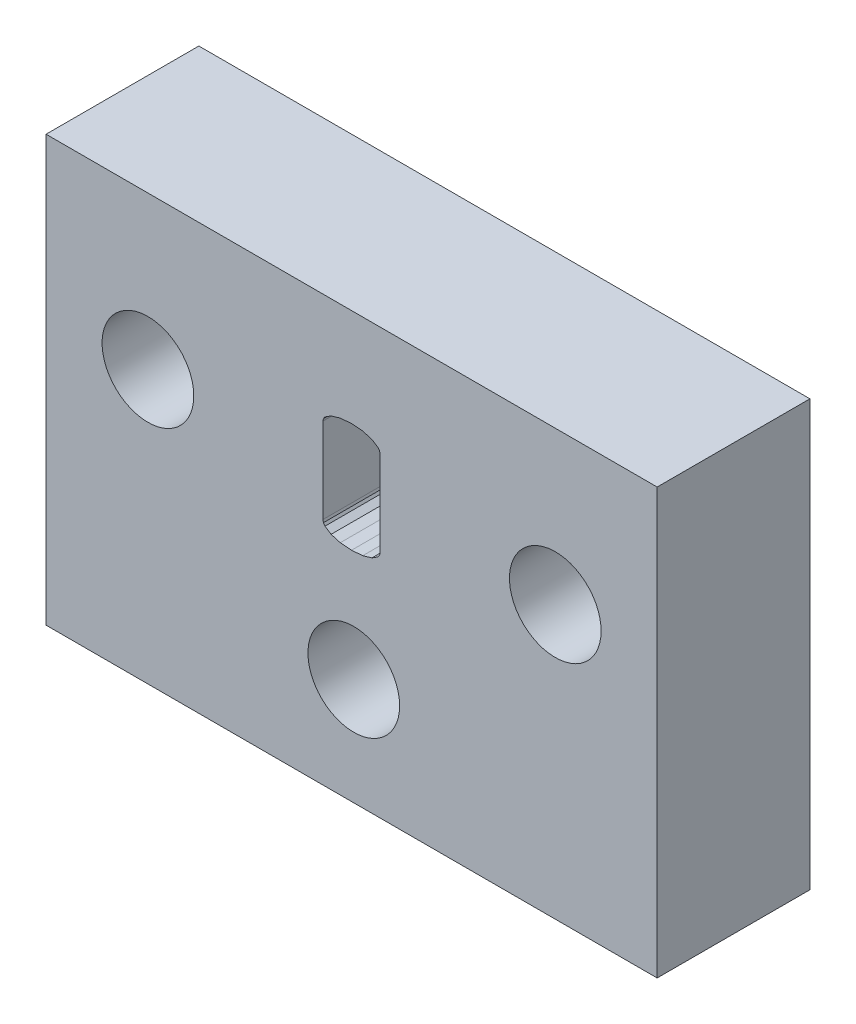
ISO-10303-21;
HEADER;
FILE_DESCRIPTION(('STEP AP214'),'2;1');
FILE_NAME('part.step','',(''),(''),'','','');
FILE_SCHEMA(('AUTOMOTIVE_DESIGN { 1 0 10303 214 1 1 1 1 }'));
ENDSEC;
DATA;
#1=APPLICATION_CONTEXT('core data for automotive mechanical design processes');
#2=APPLICATION_PROTOCOL_DEFINITION('international standard','automotive_design',2000,#1);
#3=PRODUCT_CONTEXT('',#1,'mechanical');
#4=PRODUCT('Part','Part','',(#3));
#5=PRODUCT_RELATED_PRODUCT_CATEGORY('part','',(#4));
#6=PRODUCT_DEFINITION_FORMATION('','',#4);
#7=PRODUCT_DEFINITION_CONTEXT('part definition',#1,'design');
#8=PRODUCT_DEFINITION('design','',#6,#7);
#9=PRODUCT_DEFINITION_SHAPE('','',#8);
#10=(LENGTH_UNIT() NAMED_UNIT(*) SI_UNIT(.MILLI.,.METRE.));
#11=(NAMED_UNIT(*) PLANE_ANGLE_UNIT() SI_UNIT($,.RADIAN.));
#12=(NAMED_UNIT(*) SI_UNIT($,.STERADIAN.) SOLID_ANGLE_UNIT());
#13=UNCERTAINTY_MEASURE_WITH_UNIT(LENGTH_MEASURE(1.E-05),#10,'distance_accuracy_value','');
#14=(GEOMETRIC_REPRESENTATION_CONTEXT(3) GLOBAL_UNCERTAINTY_ASSIGNED_CONTEXT((#13)) GLOBAL_UNIT_ASSIGNED_CONTEXT((#10,
#11,#12)) REPRESENTATION_CONTEXT('',''));
#15=CARTESIAN_POINT('',(0.,0.,0.));
#16=DIRECTION('',(0.,0.,1.));
#17=DIRECTION('',(1.,0.,0.));
#18=AXIS2_PLACEMENT_3D('',#15,#16,#17);
#19=CARTESIAN_POINT('',(0.,7.35355687780262,6.));
#20=DIRECTION('',(0.,-1.,0.));
#21=DIRECTION('',(0.,0.,-1.));
#22=AXIS2_PLACEMENT_3D('',#19,#20,#21);
#23=PLANE('',#22);
#24=DIRECTION('',(-1.,0.,0.));
#25=VECTOR('',#24,1.);
#26=CARTESIAN_POINT('',(0.,7.35355687780262,0.));
#27=LINE('',#26,#25);
#28=CARTESIAN_POINT('',(55.7766656600231,7.35355687780262,0.));
#29=VERTEX_POINT('',#28);
#30=CARTESIAN_POINT('',(31.7766733400216,7.35355687780262,0.));
#31=VERTEX_POINT('',#30);
#32=EDGE_CURVE('E317',#29,#31,#27,.T.);
#33=ORIENTED_EDGE('',*,*,#32,.F.);
#34=DIRECTION('',(0.,0.,-1.));
#35=VECTOR('',#34,1.);
#36=CARTESIAN_POINT('',(55.7766656600231,7.35355687780262,6.));
#37=LINE('',#36,#35);
#38=CARTESIAN_POINT('',(55.7766656600231,7.35355687780262,6.));
#39=VERTEX_POINT('',#38);
#40=EDGE_CURVE('E11',#39,#29,#37,.T.);
#41=ORIENTED_EDGE('',*,*,#40,.F.);
#42=DIRECTION('',(-1.,0.,0.));
#43=VECTOR('',#42,1.);
#44=CARTESIAN_POINT('',(0.,7.35355687780262,6.));
#45=LINE('',#44,#43);
#46=CARTESIAN_POINT('',(31.7766733400216,7.35355687780262,6.));
#47=VERTEX_POINT('',#46);
#48=EDGE_CURVE('E233',#39,#47,#45,.T.);
#49=ORIENTED_EDGE('',*,*,#48,.T.);
#50=DIRECTION('',(0.,0.,-1.));
#51=VECTOR('',#50,1.);
#52=CARTESIAN_POINT('',(31.7766733400216,7.35355687780262,6.));
#53=LINE('',#52,#51);
#54=EDGE_CURVE('E57',#47,#31,#53,.T.);
#55=ORIENTED_EDGE('',*,*,#54,.T.);
#56=EDGE_LOOP('',(#33,#41,#49,#55));
#57=FACE_BOUND('',#56,.T.);
#58=ADVANCED_FACE('F38',(#57),#23,.T.);
#59=CARTESIAN_POINT('',(55.7766656600231,0.,6.));
#60=DIRECTION('',(1.,0.,0.));
#61=DIRECTION('',(0.,0.,-1.));
#62=AXIS2_PLACEMENT_3D('',#59,#60,#61);
#63=PLANE('',#62);
#64=DIRECTION('',(0.,-1.,0.));
#65=VECTOR('',#64,1.);
#66=CARTESIAN_POINT('',(55.7766656600231,0.,0.));
#67=LINE('',#66,#65);
#68=CARTESIAN_POINT('',(55.7766656600231,24.0535515338035,0.));
#69=VERTEX_POINT('',#68);
#70=EDGE_CURVE('E222',#69,#29,#67,.T.);
#71=ORIENTED_EDGE('',*,*,#70,.F.);
#72=DIRECTION('',(0.,0.,-1.));
#73=VECTOR('',#72,1.);
#74=CARTESIAN_POINT('',(55.7766656600231,24.0535515338035,6.));
#75=LINE('',#74,#73);
#76=CARTESIAN_POINT('',(55.7766656600231,24.0535515338035,6.));
#77=VERTEX_POINT('',#76);
#78=EDGE_CURVE('E48',#77,#69,#75,.T.);
#79=ORIENTED_EDGE('',*,*,#78,.F.);
#80=DIRECTION('',(0.,-1.,0.));
#81=VECTOR('',#80,1.);
#82=CARTESIAN_POINT('',(55.7766656600231,0.,6.));
#83=LINE('',#82,#81);
#84=EDGE_CURVE('E220',#77,#39,#83,.T.);
#85=ORIENTED_EDGE('',*,*,#84,.T.);
#86=ORIENTED_EDGE('',*,*,#40,.T.);
#87=EDGE_LOOP('',(#71,#79,#85,#86));
#88=FACE_BOUND('',#87,.T.);
#89=ADVANCED_FACE('F219',(#88),#63,.T.);
#90=CARTESIAN_POINT('',(0.,24.0535515338035,6.));
#91=DIRECTION('',(0.,1.,0.));
#92=DIRECTION('',(0.,0.,1.));
#93=AXIS2_PLACEMENT_3D('',#90,#91,#92);
#94=PLANE('',#93);
#95=DIRECTION('',(1.,0.,0.));
#96=VECTOR('',#95,1.);
#97=CARTESIAN_POINT('',(0.,24.0535515338035,0.));
#98=LINE('',#97,#96);
#99=CARTESIAN_POINT('',(31.7766733400216,24.0535515338035,0.));
#100=VERTEX_POINT('',#99);
#101=EDGE_CURVE('E320',#100,#69,#98,.T.);
#102=ORIENTED_EDGE('',*,*,#101,.F.);
#103=DIRECTION('',(0.,0.,-1.));
#104=VECTOR('',#103,1.);
#105=CARTESIAN_POINT('',(31.7766733400216,24.0535515338035,6.));
#106=LINE('',#105,#104);
#107=CARTESIAN_POINT('',(31.7766733400216,24.0535515338035,6.));
#108=VERTEX_POINT('',#107);
#109=EDGE_CURVE('E136',#108,#100,#106,.T.);
#110=ORIENTED_EDGE('',*,*,#109,.F.);
#111=DIRECTION('',(1.,0.,0.));
#112=VECTOR('',#111,1.);
#113=CARTESIAN_POINT('',(0.,24.0535515338035,6.));
#114=LINE('',#113,#112);
#115=EDGE_CURVE('E232',#108,#77,#114,.T.);
#116=ORIENTED_EDGE('',*,*,#115,.T.);
#117=ORIENTED_EDGE('',*,*,#78,.T.);
#118=EDGE_LOOP('',(#102,#110,#116,#117));
#119=FACE_BOUND('',#118,.T.);
#120=ADVANCED_FACE('F235',(#119),#94,.T.);
#121=CARTESIAN_POINT('',(42.649145535972,0.,6.));
#122=DIRECTION('',(1.,0.,0.));
#123=DIRECTION('',(0.,0.,-1.));
#124=AXIS2_PLACEMENT_3D('',#121,#122,#123);
#125=PLANE('',#124);
#126=DIRECTION('',(0.,-1.,0.));
#127=VECTOR('',#126,1.);
#128=CARTESIAN_POINT('',(42.649145535972,0.,0.));
#129=LINE('',#128,#127);
#130=CARTESIAN_POINT('',(42.649145535972,19.7289243585629,0.));
#131=VERTEX_POINT('',#130);
#132=CARTESIAN_POINT('',(42.649145535972,16.3825066756361,0.));
#133=VERTEX_POINT('',#132);
#134=EDGE_CURVE('E251',#131,#133,#129,.T.);
#135=ORIENTED_EDGE('',*,*,#134,.F.);
#136=DIRECTION('',(0.,0.,-1.));
#137=VECTOR('',#136,1.);
#138=CARTESIAN_POINT('',(42.649145535972,19.7289243585629,6.));
#139=LINE('',#138,#137);
#140=CARTESIAN_POINT('',(42.649145535972,19.7289243585629,6.));
#141=VERTEX_POINT('',#140);
#142=EDGE_CURVE('E42',#141,#131,#139,.T.);
#143=ORIENTED_EDGE('',*,*,#142,.F.);
#144=DIRECTION('',(0.,-1.,0.));
#145=VECTOR('',#144,1.);
#146=CARTESIAN_POINT('',(42.649145535972,0.,6.));
#147=LINE('',#146,#145);
#148=CARTESIAN_POINT('',(42.649145535972,16.3825066756361,6.));
#149=VERTEX_POINT('',#148);
#150=EDGE_CURVE('E823',#141,#149,#147,.T.);
#151=ORIENTED_EDGE('',*,*,#150,.T.);
#152=DIRECTION('',(0.,0.,-1.));
#153=VECTOR('',#152,1.);
#154=CARTESIAN_POINT('',(42.649145535972,16.3825066756361,6.));
#155=LINE('',#154,#153);
#156=EDGE_CURVE('E238',#149,#133,#155,.T.);
#157=ORIENTED_EDGE('',*,*,#156,.T.);
#158=EDGE_LOOP('',(#135,#143,#151,#157));
#159=FACE_BOUND('',#158,.T.);
#160=ADVANCED_FACE('F376',(#159),#125,.T.);
#161=CARTESIAN_POINT('',(36.9156420107493,-7.71289762505106,6.));
#162=DIRECTION('',(0.978863045607265,-0.204516840246639,0.));
#163=DIRECTION('',(0.204516840246639,0.978863045607265,0.));
#164=AXIS2_PLACEMENT_3D('',#161,#162,#163);
#165=PLANE('',#164);
#166=DIRECTION('',(-0.204516840246639,-0.978863045607265,0.));
#167=VECTOR('',#166,1.);
#168=CARTESIAN_POINT('',(36.9156420107493,-7.71289762505106,0.));
#169=LINE('',#168,#167);
#170=CARTESIAN_POINT('',(42.6692424776641,19.8251127874882,0.));
#171=VERTEX_POINT('',#170);
#172=EDGE_CURVE('E254',#171,#131,#169,.T.);
#173=ORIENTED_EDGE('',*,*,#172,.F.);
#174=DIRECTION('',(0.,0.,-1.));
#175=VECTOR('',#174,1.);
#176=CARTESIAN_POINT('',(42.6692424776641,19.8251127874882,6.));
#177=LINE('',#176,#175);
#178=CARTESIAN_POINT('',(42.6692424776641,19.8251127874882,6.));
#179=VERTEX_POINT('',#178);
#180=EDGE_CURVE('E366',#179,#171,#177,.T.);
#181=ORIENTED_EDGE('',*,*,#180,.F.);
#182=DIRECTION('',(-0.204516840246639,-0.978863045607265,0.));
#183=VECTOR('',#182,1.);
#184=CARTESIAN_POINT('',(36.9156420107493,-7.71289762505106,6.));
#185=LINE('',#184,#183);
#186=EDGE_CURVE('E375',#179,#141,#185,.T.);
#187=ORIENTED_EDGE('',*,*,#186,.T.);
#188=ORIENTED_EDGE('',*,*,#142,.T.);
#189=EDGE_LOOP('',(#173,#181,#187,#188));
#190=FACE_BOUND('',#189,.T.);
#191=ADVANCED_FACE('F373',(#190),#165,.T.);
#192=CARTESIAN_POINT('',(19.9866293779274,-13.5737748567197,6.));
#193=DIRECTION('',(0.827256105951334,-0.561825004041504,0.));
#194=DIRECTION('',(0.561825004041504,0.827256105951334,0.));
#195=AXIS2_PLACEMENT_3D('',#192,#193,#194);
#196=PLANE('',#195);
#197=DIRECTION('',(-0.561825004041504,-0.827256105951334,0.));
#198=VECTOR('',#197,1.);
#199=CARTESIAN_POINT('',(19.9866293779274,-13.5737748567197,0.));
#200=LINE('',#199,#198);
#201=CARTESIAN_POINT('',(42.7295333027403,19.9138876779227,0.));
#202=VERTEX_POINT('',#201);
#203=EDGE_CURVE('E257',#202,#171,#200,.T.);
#204=ORIENTED_EDGE('',*,*,#203,.F.);
#205=DIRECTION('',(0.,0.,-1.));
#206=VECTOR('',#205,1.);
#207=CARTESIAN_POINT('',(42.7295333027403,19.9138876779227,6.));
#208=LINE('',#207,#206);
#209=CARTESIAN_POINT('',(42.7295333027403,19.9138876779227,6.));
#210=VERTEX_POINT('',#209);
#211=EDGE_CURVE('E365',#210,#202,#208,.T.);
#212=ORIENTED_EDGE('',*,*,#211,.F.);
#213=DIRECTION('',(-0.561825004041504,-0.827256105951334,0.));
#214=VECTOR('',#213,1.);
#215=CARTESIAN_POINT('',(19.9866293779274,-13.5737748567197,6.));
#216=LINE('',#215,#214);
#217=EDGE_CURVE('E384',#210,#179,#216,.T.);
#218=ORIENTED_EDGE('',*,*,#217,.T.);
#219=ORIENTED_EDGE('',*,*,#180,.T.);
#220=EDGE_LOOP('',(#204,#212,#218,#219));
#221=FACE_BOUND('',#220,.T.);
#222=ADVANCED_FACE('F382',(#221),#196,.T.);
#223=CARTESIAN_POINT('',(3.46137516770395,-5.37480616103268,6.));
#224=DIRECTION('',(0.541437291995267,-0.840741136638878,0.));
#225=DIRECTION('',(0.840741136638878,0.541437291995267,0.));
#226=AXIS2_PLACEMENT_3D('',#223,#224,#225);
#227=PLANE('',#226);
#228=DIRECTION('',(-0.840741136638878,-0.541437291995267,0.));
#229=VECTOR('',#228,1.);
#230=CARTESIAN_POINT('',(3.46137516770395,-5.37480616103268,0.));
#231=LINE('',#230,#229);
#232=CARTESIAN_POINT('',(42.9706966030451,20.069196843319,0.));
#233=VERTEX_POINT('',#232);
#234=EDGE_CURVE('E260',#233,#202,#231,.T.);
#235=ORIENTED_EDGE('',*,*,#234,.F.);
#236=DIRECTION('',(0.,0.,-1.));
#237=VECTOR('',#236,1.);
#238=CARTESIAN_POINT('',(42.9706966030451,20.069196843319,6.));
#239=LINE('',#238,#237);
#240=CARTESIAN_POINT('',(42.9706966030451,20.069196843319,6.));
#241=VERTEX_POINT('',#240);
#242=EDGE_CURVE('E363',#241,#233,#239,.T.);
#243=ORIENTED_EDGE('',*,*,#242,.F.);
#244=DIRECTION('',(-0.840741136638878,-0.541437291995267,0.));
#245=VECTOR('',#244,1.);
#246=CARTESIAN_POINT('',(3.46137516770395,-5.37480616103268,6.));
#247=LINE('',#246,#245);
#248=EDGE_CURVE('E390',#241,#210,#247,.T.);
#249=ORIENTED_EDGE('',*,*,#248,.T.);
#250=ORIENTED_EDGE('',*,*,#211,.T.);
#251=EDGE_LOOP('',(#235,#243,#249,#250));
#252=FACE_BOUND('',#251,.T.);
#253=ADVANCED_FACE('F393',(#252),#227,.T.);
#254=CARTESIAN_POINT('',(-2.0262679232618,6.94959281061655,6.));
#255=DIRECTION('',(0.279911308019681,-0.960025864048834,0.));
#256=DIRECTION('',(0.960025864048834,0.279911308019681,0.));
#257=AXIS2_PLACEMENT_3D('',#254,#255,#256);
#258=PLANE('',#257);
#259=DIRECTION('',(-0.960025864048835,-0.279911308019681,0.));
#260=VECTOR('',#259,1.);
#261=CARTESIAN_POINT('',(-2.0262679232618,6.94959281061655,0.));
#262=LINE('',#261,#260);
#263=CARTESIAN_POINT('',(43.3320604559415,20.17455840963,0.));
#264=VERTEX_POINT('',#263);
#265=EDGE_CURVE('E263',#264,#233,#262,.T.);
#266=ORIENTED_EDGE('',*,*,#265,.F.);
#267=DIRECTION('',(0.,0.,-1.));
#268=VECTOR('',#267,1.);
#269=CARTESIAN_POINT('',(43.3320604559415,20.17455840963,6.));
#270=LINE('',#269,#268);
#271=CARTESIAN_POINT('',(43.3320604559415,20.17455840963,6.));
#272=VERTEX_POINT('',#271);
#273=EDGE_CURVE('E361',#272,#264,#270,.T.);
#274=ORIENTED_EDGE('',*,*,#273,.F.);
#275=DIRECTION('',(-0.960025864048835,-0.279911308019681,0.));
#276=VECTOR('',#275,1.);
#277=CARTESIAN_POINT('',(-2.0262679232618,6.94959281061655,6.));
#278=LINE('',#277,#276);
#279=EDGE_CURVE('E394',#272,#241,#278,.T.);
#280=ORIENTED_EDGE('',*,*,#279,.T.);
#281=ORIENTED_EDGE('',*,*,#242,.T.);
#282=EDGE_LOOP('',(#266,#274,#280,#281));
#283=FACE_BOUND('',#282,.T.);
#284=ADVANCED_FACE('F537',(#283),#258,.T.);
#285=CARTESIAN_POINT('',(-1.32347644977872,16.6181788602184,6.));
#286=DIRECTION('',(0.0793889148362224,-0.996843719045833,0.));
#287=DIRECTION('',(0.996843719045833,0.0793889148362224,0.));
#288=AXIS2_PLACEMENT_3D('',#285,#286,#287);
#289=PLANE('',#288);
#290=DIRECTION('',(-0.996843719045833,-0.0793889148362224,0.));
#291=VECTOR('',#290,1.);
#292=CARTESIAN_POINT('',(-1.32347644977872,16.6181788602184,0.));
#293=LINE('',#292,#291);
#294=CARTESIAN_POINT('',(43.7730498804842,20.2096789317337,0.));
#295=VERTEX_POINT('',#294);
#296=EDGE_CURVE('E266',#295,#264,#293,.T.);
#297=ORIENTED_EDGE('',*,*,#296,.F.);
#298=DIRECTION('',(0.,0.,-1.));
#299=VECTOR('',#298,1.);
#300=CARTESIAN_POINT('',(43.7730498804842,20.2096789317337,6.));
#301=LINE('',#300,#299);
#302=CARTESIAN_POINT('',(43.7730498804842,20.2096789317337,6.));
#303=VERTEX_POINT('',#302);
#304=EDGE_CURVE('E359',#303,#295,#301,.T.);
#305=ORIENTED_EDGE('',*,*,#304,.F.);
#306=DIRECTION('',(-0.996843719045833,-0.0793889148362224,0.));
#307=VECTOR('',#306,1.);
#308=CARTESIAN_POINT('',(-1.32347644977872,16.6181788602184,6.));
#309=LINE('',#308,#307);
#310=EDGE_CURVE('E396',#303,#272,#309,.T.);
#311=ORIENTED_EDGE('',*,*,#310,.T.);
#312=ORIENTED_EDGE('',*,*,#273,.T.);
#313=EDGE_LOOP('',(#297,#305,#311,#312));
#314=FACE_BOUND('',#313,.T.);
#315=ADVANCED_FACE('F533',(#314),#289,.T.);
#316=CARTESIAN_POINT('',(1.87524448052431,23.5464319665082,6.));
#317=DIRECTION('',(-0.0793889148362224,-0.996843719045833,0.));
#318=DIRECTION('',(0.996843719045833,-0.0793889148362224,0.));
#319=AXIS2_PLACEMENT_3D('',#316,#317,#318);
#320=PLANE('',#319);
#321=DIRECTION('',(-0.996843719045833,0.0793889148362224,0.));
#322=VECTOR('',#321,1.);
#323=CARTESIAN_POINT('',(1.87524448052431,23.5464319665082,0.));
#324=LINE('',#323,#322);
#325=CARTESIAN_POINT('',(44.2140393050269,20.17455840963,0.));
#326=VERTEX_POINT('',#325);
#327=EDGE_CURVE('E269',#326,#295,#324,.T.);
#328=ORIENTED_EDGE('',*,*,#327,.F.);
#329=DIRECTION('',(0.,0.,-1.));
#330=VECTOR('',#329,1.);
#331=CARTESIAN_POINT('',(44.2140393050269,20.17455840963,6.));
#332=LINE('',#331,#330);
#333=CARTESIAN_POINT('',(44.2140393050269,20.17455840963,6.));
#334=VERTEX_POINT('',#333);
#335=EDGE_CURVE('E357',#334,#326,#332,.T.);
#336=ORIENTED_EDGE('',*,*,#335,.F.);
#337=DIRECTION('',(-0.996843719045833,0.0793889148362224,0.));
#338=VECTOR('',#337,1.);
#339=CARTESIAN_POINT('',(1.87524448052431,23.5464319665082,6.));
#340=LINE('',#339,#338);
#341=EDGE_CURVE('E402',#334,#303,#340,.T.);
#342=ORIENTED_EDGE('',*,*,#341,.T.);
#343=ORIENTED_EDGE('',*,*,#304,.T.);
#344=EDGE_LOOP('',(#328,#336,#342,#343));
#345=FACE_BOUND('',#344,.T.);
#346=ADVANCED_FACE('F529',(#345),#320,.T.);
#347=CARTESIAN_POINT('',(8.8855346364864,30.4751641771087,6.));
#348=DIRECTION('',(-0.279911308019671,-0.960025864048837,0.));
#349=DIRECTION('',(0.960025864048837,-0.279911308019671,0.));
#350=AXIS2_PLACEMENT_3D('',#347,#348,#349);
#351=PLANE('',#350);
#352=DIRECTION('',(-0.960025864048837,0.279911308019671,0.));
#353=VECTOR('',#352,1.);
#354=CARTESIAN_POINT('',(8.8855346364864,30.4751641771087,0.));
#355=LINE('',#354,#353);
#356=CARTESIAN_POINT('',(44.5754031579232,20.069196843319,0.));
#357=VERTEX_POINT('',#356);
#358=EDGE_CURVE('E272',#357,#326,#355,.T.);
#359=ORIENTED_EDGE('',*,*,#358,.F.);
#360=DIRECTION('',(0.,0.,-1.));
#361=VECTOR('',#360,1.);
#362=CARTESIAN_POINT('',(44.5754031579232,20.069196843319,6.));
#363=LINE('',#362,#361);
#364=CARTESIAN_POINT('',(44.5754031579232,20.069196843319,6.));
#365=VERTEX_POINT('',#364);
#366=EDGE_CURVE('E355',#365,#357,#363,.T.);
#367=ORIENTED_EDGE('',*,*,#366,.F.);
#368=DIRECTION('',(-0.960025864048837,0.279911308019671,0.));
#369=VECTOR('',#368,1.);
#370=CARTESIAN_POINT('',(8.8855346364864,30.4751641771087,6.));
#371=LINE('',#370,#369);
#372=EDGE_CURVE('E405',#365,#334,#371,.T.);
#373=ORIENTED_EDGE('',*,*,#372,.T.);
#374=ORIENTED_EDGE('',*,*,#335,.T.);
#375=EDGE_LOOP('',(#359,#367,#373,#374));
#376=FACE_BOUND('',#375,.T.);
#377=ADVANCED_FACE('F525',(#376),#351,.T.);
#378=CARTESIAN_POINT('',(22.2031440291283,34.4769317222588,6.));
#379=DIRECTION('',(-0.541437291995278,-0.840741136638871,0.));
#380=DIRECTION('',(0.840741136638871,-0.541437291995278,0.));
#381=AXIS2_PLACEMENT_3D('',#378,#379,#380);
#382=PLANE('',#381);
#383=DIRECTION('',(-0.840741136638871,0.541437291995278,0.));
#384=VECTOR('',#383,1.);
#385=CARTESIAN_POINT('',(22.2031440291283,34.4769317222588,0.));
#386=LINE('',#385,#384);
#387=CARTESIAN_POINT('',(44.8165664582281,19.9138876779227,0.));
#388=VERTEX_POINT('',#387);
#389=EDGE_CURVE('E275',#388,#357,#386,.T.);
#390=ORIENTED_EDGE('',*,*,#389,.F.);
#391=DIRECTION('',(0.,0.,-1.));
#392=VECTOR('',#391,1.);
#393=CARTESIAN_POINT('',(44.8165664582281,19.9138876779227,6.));
#394=LINE('',#393,#392);
#395=CARTESIAN_POINT('',(44.8165664582281,19.9138876779227,6.));
#396=VERTEX_POINT('',#395);
#397=EDGE_CURVE('E353',#396,#388,#394,.T.);
#398=ORIENTED_EDGE('',*,*,#397,.F.);
#399=DIRECTION('',(-0.840741136638871,0.541437291995278,0.));
#400=VECTOR('',#399,1.);
#401=CARTESIAN_POINT('',(22.2031440291283,34.4769317222588,6.));
#402=LINE('',#401,#400);
#403=EDGE_CURVE('E408',#396,#365,#402,.T.);
#404=ORIENTED_EDGE('',*,*,#403,.T.);
#405=ORIENTED_EDGE('',*,*,#366,.T.);
#406=EDGE_LOOP('',(#390,#398,#404,#405));
#407=FACE_BOUND('',#406,.T.);
#408=ADVANCED_FACE('F521',(#407),#382,.T.);
#409=CARTESIAN_POINT('',(39.925777289292,27.1153030186747,6.));
#410=DIRECTION('',(-0.827256105951304,-0.561825004041548,0.));
#411=DIRECTION('',(0.561825004041548,-0.827256105951304,0.));
#412=AXIS2_PLACEMENT_3D('',#409,#410,#411);
#413=PLANE('',#412);
#414=DIRECTION('',(-0.561825004041548,0.827256105951304,0.));
#415=VECTOR('',#414,1.);
#416=CARTESIAN_POINT('',(39.925777289292,27.1153030186747,0.));
#417=LINE('',#416,#415);
#418=CARTESIAN_POINT('',(44.8768572833043,19.8251127874883,0.));
#419=VERTEX_POINT('',#418);
#420=EDGE_CURVE('E278',#419,#388,#417,.T.);
#421=ORIENTED_EDGE('',*,*,#420,.F.);
#422=DIRECTION('',(0.,0.,-1.));
#423=VECTOR('',#422,1.);
#424=CARTESIAN_POINT('',(44.8768572833043,19.8251127874883,6.));
#425=LINE('',#424,#423);
#426=CARTESIAN_POINT('',(44.8768572833043,19.8251127874883,6.));
#427=VERTEX_POINT('',#426);
#428=EDGE_CURVE('E351',#427,#419,#425,.T.);
#429=ORIENTED_EDGE('',*,*,#428,.F.);
#430=DIRECTION('',(-0.561825004041548,0.827256105951304,0.));
#431=VECTOR('',#430,1.);
#432=CARTESIAN_POINT('',(39.925777289292,27.1153030186747,6.));
#433=LINE('',#432,#431);
#434=EDGE_CURVE('E411',#427,#396,#433,.T.);
#435=ORIENTED_EDGE('',*,*,#434,.T.);
#436=ORIENTED_EDGE('',*,*,#397,.T.);
#437=EDGE_LOOP('',(#421,#429,#435,#436));
#438=FACE_BOUND('',#437,.T.);
#439=ADVANCED_FACE('F517',(#438),#413,.T.);
#440=CARTESIAN_POINT('',(46.9686549590168,9.8133042676024,6.));
#441=DIRECTION('',(-0.978863045607251,-0.204516840246706,0.));
#442=DIRECTION('',(0.204516840246707,-0.978863045607251,0.));
#443=AXIS2_PLACEMENT_3D('',#440,#441,#442);
#444=PLANE('',#443);
#445=DIRECTION('',(-0.204516840246707,0.978863045607251,0.));
#446=VECTOR('',#445,1.);
#447=CARTESIAN_POINT('',(46.9686549590168,9.8133042676024,0.));
#448=LINE('',#447,#446);
#449=CARTESIAN_POINT('',(44.8969542249964,19.7289243585629,0.));
#450=VERTEX_POINT('',#449);
#451=EDGE_CURVE('E281',#450,#419,#448,.T.);
#452=ORIENTED_EDGE('',*,*,#451,.F.);
#453=DIRECTION('',(0.,0.,-1.));
#454=VECTOR('',#453,1.);
#455=CARTESIAN_POINT('',(44.8969542249964,19.7289243585629,6.));
#456=LINE('',#455,#454);
#457=CARTESIAN_POINT('',(44.8969542249964,19.7289243585629,6.));
#458=VERTEX_POINT('',#457);
#459=EDGE_CURVE('E349',#458,#450,#456,.T.);
#460=ORIENTED_EDGE('',*,*,#459,.F.);
#461=DIRECTION('',(-0.204516840246707,0.978863045607251,0.));
#462=VECTOR('',#461,1.);
#463=CARTESIAN_POINT('',(46.9686549590168,9.8133042676024,6.));
#464=LINE('',#463,#462);
#465=EDGE_CURVE('E414',#458,#427,#464,.T.);
#466=ORIENTED_EDGE('',*,*,#465,.T.);
#467=ORIENTED_EDGE('',*,*,#428,.T.);
#468=EDGE_LOOP('',(#452,#460,#466,#467));
#469=FACE_BOUND('',#468,.T.);
#470=ADVANCED_FACE('F513',(#469),#444,.T.);
#471=CARTESIAN_POINT('',(44.8969542249964,0.,6.));
#472=DIRECTION('',(-1.,0.,0.));
#473=DIRECTION('',(0.,0.,1.));
#474=AXIS2_PLACEMENT_3D('',#471,#472,#473);
#475=PLANE('',#474);
#476=DIRECTION('',(0.,1.,0.));
#477=VECTOR('',#476,1.);
#478=CARTESIAN_POINT('',(44.8969542249964,0.,0.));
#479=LINE('',#478,#477);
#480=CARTESIAN_POINT('',(44.8969542249964,16.3825066756361,0.));
#481=VERTEX_POINT('',#480);
#482=EDGE_CURVE('E284',#481,#450,#479,.T.);
#483=ORIENTED_EDGE('',*,*,#482,.F.);
#484=DIRECTION('',(0.,0.,-1.));
#485=VECTOR('',#484,1.);
#486=CARTESIAN_POINT('',(44.8969542249964,16.3825066756361,6.));
#487=LINE('',#486,#485);
#488=CARTESIAN_POINT('',(44.8969542249964,16.3825066756361,6.));
#489=VERTEX_POINT('',#488);
#490=EDGE_CURVE('E347',#489,#481,#487,.T.);
#491=ORIENTED_EDGE('',*,*,#490,.F.);
#492=DIRECTION('',(0.,1.,0.));
#493=VECTOR('',#492,1.);
#494=CARTESIAN_POINT('',(44.8969542249964,0.,6.));
#495=LINE('',#494,#493);
#496=EDGE_CURVE('E417',#489,#458,#495,.T.);
#497=ORIENTED_EDGE('',*,*,#496,.T.);
#498=ORIENTED_EDGE('',*,*,#459,.T.);
#499=EDGE_LOOP('',(#483,#491,#497,#498));
#500=FACE_BOUND('',#499,.T.);
#501=ADVANCED_FACE('F509',(#500),#475,.T.);
#502=CARTESIAN_POINT('',(39.7393639607165,-8.30286646036402,6.));
#503=DIRECTION('',(-0.978863045607238,0.20451684024677,0.));
#504=DIRECTION('',(-0.20451684024677,-0.978863045607238,0.));
#505=AXIS2_PLACEMENT_3D('',#502,#503,#504);
#506=PLANE('',#505);
#507=DIRECTION('',(0.20451684024677,0.978863045607238,0.));
#508=VECTOR('',#507,1.);
#509=CARTESIAN_POINT('',(39.7393639607165,-8.30286646036402,0.));
#510=LINE('',#509,#508);
#511=CARTESIAN_POINT('',(44.8768572833043,16.2863182467108,0.));
#512=VERTEX_POINT('',#511);
#513=EDGE_CURVE('E287',#512,#481,#510,.T.);
#514=ORIENTED_EDGE('',*,*,#513,.F.);
#515=DIRECTION('',(0.,0.,-1.));
#516=VECTOR('',#515,1.);
#517=CARTESIAN_POINT('',(44.8768572833043,16.2863182467108,6.));
#518=LINE('',#517,#516);
#519=CARTESIAN_POINT('',(44.8768572833043,16.2863182467108,6.));
#520=VERTEX_POINT('',#519);
#521=EDGE_CURVE('E345',#520,#512,#518,.T.);
#522=ORIENTED_EDGE('',*,*,#521,.F.);
#523=DIRECTION('',(0.20451684024677,0.978863045607238,0.));
#524=VECTOR('',#523,1.);
#525=CARTESIAN_POINT('',(39.7393639607165,-8.30286646036402,6.));
#526=LINE('',#525,#524);
#527=EDGE_CURVE('E420',#520,#489,#526,.T.);
#528=ORIENTED_EDGE('',*,*,#527,.T.);
#529=ORIENTED_EDGE('',*,*,#490,.T.);
#530=EDGE_LOOP('',(#514,#522,#528,#529));
#531=FACE_BOUND('',#530,.T.);
#532=ADVANCED_FACE('F505',(#531),#506,.T.);
#533=CARTESIAN_POINT('',(23.1421531923389,-15.7168260436886,6.));
#534=DIRECTION('',(-0.827256105951304,0.561825004041548,0.));
#535=DIRECTION('',(-0.561825004041548,-0.827256105951304,0.));
#536=AXIS2_PLACEMENT_3D('',#533,#534,#535);
#537=PLANE('',#536);
#538=DIRECTION('',(0.561825004041548,0.827256105951304,0.));
#539=VECTOR('',#538,1.);
#540=CARTESIAN_POINT('',(23.1421531923389,-15.7168260436886,0.));
#541=LINE('',#540,#539);
#542=CARTESIAN_POINT('',(44.8165664582281,16.1975433562764,0.));
#543=VERTEX_POINT('',#542);
#544=EDGE_CURVE('E290',#543,#512,#541,.T.);
#545=ORIENTED_EDGE('',*,*,#544,.F.);
#546=DIRECTION('',(0.,0.,-1.));
#547=VECTOR('',#546,1.);
#548=CARTESIAN_POINT('',(44.8165664582281,16.1975433562764,6.));
#549=LINE('',#548,#547);
#550=CARTESIAN_POINT('',(44.8165664582281,16.1975433562764,6.));
#551=VERTEX_POINT('',#550);
#552=EDGE_CURVE('E343',#551,#543,#549,.T.);
#553=ORIENTED_EDGE('',*,*,#552,.F.);
#554=DIRECTION('',(0.561825004041548,0.827256105951304,0.));
#555=VECTOR('',#554,1.);
#556=CARTESIAN_POINT('',(23.1421531923389,-15.7168260436886,6.));
#557=LINE('',#556,#555);
#558=EDGE_CURVE('E423',#551,#520,#557,.T.);
#559=ORIENTED_EDGE('',*,*,#558,.T.);
#560=ORIENTED_EDGE('',*,*,#521,.T.);
#561=EDGE_LOOP('',(#545,#553,#559,#560));
#562=FACE_BOUND('',#561,.T.);
#563=ADVANCED_FACE('F501',(#562),#537,.T.);
#564=CARTESIAN_POINT('',(5.76490990911292,-8.95172346135503,6.));
#565=DIRECTION('',(-0.541437291995406,0.840741136638788,0.));
#566=DIRECTION('',(-0.840741136638788,-0.541437291995406,0.));
#567=AXIS2_PLACEMENT_3D('',#564,#565,#566);
#568=PLANE('',#567);
#569=DIRECTION('',(0.840741136638788,0.541437291995406,0.));
#570=VECTOR('',#569,1.);
#571=CARTESIAN_POINT('',(5.76490990911292,-8.95172346135503,0.));
#572=LINE('',#571,#570);
#573=CARTESIAN_POINT('',(44.5754031579232,16.04223419088,0.));
#574=VERTEX_POINT('',#573);
#575=EDGE_CURVE('E293',#574,#543,#572,.T.);
#576=ORIENTED_EDGE('',*,*,#575,.F.);
#577=DIRECTION('',(0.,0.,-1.));
#578=VECTOR('',#577,1.);
#579=CARTESIAN_POINT('',(44.5754031579232,16.04223419088,6.));
#580=LINE('',#579,#578);
#581=CARTESIAN_POINT('',(44.5754031579232,16.04223419088,6.));
#582=VERTEX_POINT('',#581);
#583=EDGE_CURVE('E341',#582,#574,#580,.T.);
#584=ORIENTED_EDGE('',*,*,#583,.F.);
#585=DIRECTION('',(0.840741136638788,0.541437291995406,0.));
#586=VECTOR('',#585,1.);
#587=CARTESIAN_POINT('',(5.76490990911292,-8.95172346135503,6.));
#588=LINE('',#587,#586);
#589=EDGE_CURVE('E426',#582,#551,#588,.T.);
#590=ORIENTED_EDGE('',*,*,#589,.T.);
#591=ORIENTED_EDGE('',*,*,#552,.T.);
#592=EDGE_LOOP('',(#576,#584,#590,#591));
#593=FACE_BOUND('',#592,.T.);
#594=ADVANCED_FACE('F497',(#593),#568,.T.);
#595=CARTESIAN_POINT('',(-0.818404776699808,2.80692394477223,6.));
#596=DIRECTION('',(-0.279911308019671,0.960025864048837,0.));
#597=DIRECTION('',(-0.960025864048837,-0.279911308019671,0.));
#598=AXIS2_PLACEMENT_3D('',#595,#596,#597);
#599=PLANE('',#598);
#600=DIRECTION('',(0.960025864048837,0.279911308019671,0.));
#601=VECTOR('',#600,1.);
#602=CARTESIAN_POINT('',(-0.818404776699808,2.80692394477223,0.));
#603=LINE('',#602,#601);
#604=CARTESIAN_POINT('',(44.2140393050269,15.936872624569,0.));
#605=VERTEX_POINT('',#604);
#606=EDGE_CURVE('E296',#605,#574,#603,.T.);
#607=ORIENTED_EDGE('',*,*,#606,.F.);
#608=DIRECTION('',(0.,0.,-1.));
#609=VECTOR('',#608,1.);
#610=CARTESIAN_POINT('',(44.2140393050269,15.936872624569,6.));
#611=LINE('',#610,#609);
#612=CARTESIAN_POINT('',(44.2140393050269,15.936872624569,6.));
#613=VERTEX_POINT('',#612);
#614=EDGE_CURVE('E339',#613,#605,#611,.T.);
#615=ORIENTED_EDGE('',*,*,#614,.F.);
#616=DIRECTION('',(0.960025864048837,0.279911308019671,0.));
#617=VECTOR('',#616,1.);
#618=CARTESIAN_POINT('',(-0.818404776699808,2.80692394477223,6.));
#619=LINE('',#618,#617);
#620=EDGE_CURVE('E429',#613,#582,#619,.T.);
#621=ORIENTED_EDGE('',*,*,#620,.T.);
#622=ORIENTED_EDGE('',*,*,#583,.T.);
#623=EDGE_LOOP('',(#607,#615,#621,#622));
#624=FACE_BOUND('',#623,.T.);
#625=ADVANCED_FACE('F493',(#624),#599,.T.);
#626=CARTESIAN_POINT('',(-0.982554266857598,12.3374031697293,6.));
#627=DIRECTION('',(-0.079388914835973,0.996843719045852,0.));
#628=DIRECTION('',(-0.996843719045853,-0.079388914835973,0.));
#629=AXIS2_PLACEMENT_3D('',#626,#627,#628);
#630=PLANE('',#629);
#631=DIRECTION('',(0.996843719045853,0.079388914835973,0.));
#632=VECTOR('',#631,1.);
#633=CARTESIAN_POINT('',(-0.982554266857598,12.3374031697293,0.));
#634=LINE('',#633,#632);
#635=CARTESIAN_POINT('',(43.7730498804842,15.9017521024654,0.));
#636=VERTEX_POINT('',#635);
#637=EDGE_CURVE('E299',#636,#605,#634,.T.);
#638=ORIENTED_EDGE('',*,*,#637,.F.);
#639=DIRECTION('',(0.,0.,-1.));
#640=VECTOR('',#639,1.);
#641=CARTESIAN_POINT('',(43.7730498804842,15.9017521024654,6.));
#642=LINE('',#641,#640);
#643=CARTESIAN_POINT('',(43.7730498804842,15.9017521024654,6.));
#644=VERTEX_POINT('',#643);
#645=EDGE_CURVE('E337',#644,#636,#642,.T.);
#646=ORIENTED_EDGE('',*,*,#645,.F.);
#647=DIRECTION('',(0.996843719045853,0.079388914835973,0.));
#648=VECTOR('',#647,1.);
#649=CARTESIAN_POINT('',(-0.982554266857598,12.3374031697293,6.));
#650=LINE('',#649,#648);
#651=EDGE_CURVE('E432',#644,#613,#650,.T.);
#652=ORIENTED_EDGE('',*,*,#651,.T.);
#653=ORIENTED_EDGE('',*,*,#614,.T.);
#654=EDGE_LOOP('',(#638,#646,#652,#653));
#655=FACE_BOUND('',#654,.T.);
#656=ADVANCED_FACE('F489',(#655),#630,.T.);
#657=CARTESIAN_POINT('',(1.53432229759972,19.2656562759974,6.));
#658=DIRECTION('',(0.079388914835973,0.996843719045852,0.));
#659=DIRECTION('',(-0.996843719045853,0.079388914835973,0.));
#660=AXIS2_PLACEMENT_3D('',#657,#658,#659);
#661=PLANE('',#660);
#662=DIRECTION('',(0.996843719045853,-0.079388914835973,0.));
#663=VECTOR('',#662,1.);
#664=CARTESIAN_POINT('',(1.53432229759972,19.2656562759974,0.));
#665=LINE('',#664,#663);
#666=CARTESIAN_POINT('',(43.3320604559415,15.936872624569,0.));
#667=VERTEX_POINT('',#666);
#668=EDGE_CURVE('E302',#667,#636,#665,.T.);
#669=ORIENTED_EDGE('',*,*,#668,.F.);
#670=DIRECTION('',(0.,0.,-1.));
#671=VECTOR('',#670,1.);
#672=CARTESIAN_POINT('',(43.3320604559415,15.936872624569,6.));
#673=LINE('',#672,#671);
#674=CARTESIAN_POINT('',(43.3320604559415,15.936872624569,6.));
#675=VERTEX_POINT('',#674);
#676=EDGE_CURVE('E335',#675,#667,#673,.T.);
#677=ORIENTED_EDGE('',*,*,#676,.F.);
#678=DIRECTION('',(0.996843719045853,-0.079388914835973,0.));
#679=VECTOR('',#678,1.);
#680=CARTESIAN_POINT('',(1.53432229759972,19.2656562759974,6.));
#681=LINE('',#680,#679);
#682=EDGE_CURVE('E435',#675,#644,#681,.T.);
#683=ORIENTED_EDGE('',*,*,#682,.T.);
#684=ORIENTED_EDGE('',*,*,#645,.T.);
#685=EDGE_LOOP('',(#669,#677,#683,#684));
#686=FACE_BOUND('',#685,.T.);
#687=ADVANCED_FACE('F485',(#686),#661,.T.);
#688=CARTESIAN_POINT('',(7.67767148992472,26.3324953112642,6.));
#689=DIRECTION('',(0.279911308019681,0.960025864048834,0.));
#690=DIRECTION('',(-0.960025864048834,0.279911308019681,0.));
#691=AXIS2_PLACEMENT_3D('',#688,#689,#690);
#692=PLANE('',#691);
#693=DIRECTION('',(0.960025864048835,-0.279911308019681,0.));
#694=VECTOR('',#693,1.);
#695=CARTESIAN_POINT('',(7.67767148992472,26.3324953112642,0.));
#696=LINE('',#695,#694);
#697=CARTESIAN_POINT('',(42.9706966030451,16.04223419088,0.));
#698=VERTEX_POINT('',#697);
#699=EDGE_CURVE('E305',#698,#667,#696,.T.);
#700=ORIENTED_EDGE('',*,*,#699,.F.);
#701=DIRECTION('',(0.,0.,-1.));
#702=VECTOR('',#701,1.);
#703=CARTESIAN_POINT('',(42.9706966030451,16.04223419088,6.));
#704=LINE('',#703,#702);
#705=CARTESIAN_POINT('',(42.9706966030451,16.04223419088,6.));
#706=VERTEX_POINT('',#705);
#707=EDGE_CURVE('E333',#706,#698,#704,.T.);
#708=ORIENTED_EDGE('',*,*,#707,.F.);
#709=DIRECTION('',(0.960025864048835,-0.279911308019681,0.));
#710=VECTOR('',#709,1.);
#711=CARTESIAN_POINT('',(7.67767148992472,26.3324953112642,6.));
#712=LINE('',#711,#710);
#713=EDGE_CURVE('E438',#706,#675,#712,.T.);
#714=ORIENTED_EDGE('',*,*,#713,.T.);
#715=ORIENTED_EDGE('',*,*,#676,.T.);
#716=EDGE_LOOP('',(#700,#708,#714,#715));
#717=FACE_BOUND('',#716,.T.);
#718=ADVANCED_FACE('F481',(#717),#692,.T.);
#719=CARTESIAN_POINT('',(19.8996092877313,30.9000144219424,6.));
#720=DIRECTION('',(0.541437291995395,0.840741136638795,0.));
#721=DIRECTION('',(-0.840741136638796,0.541437291995395,0.));
#722=AXIS2_PLACEMENT_3D('',#719,#720,#721);
#723=PLANE('',#722);
#724=DIRECTION('',(0.840741136638795,-0.541437291995395,0.));
#725=VECTOR('',#724,1.);
#726=CARTESIAN_POINT('',(19.8996092877313,30.9000144219424,0.));
#727=LINE('',#726,#725);
#728=CARTESIAN_POINT('',(42.7295333027403,16.1975433562764,0.));
#729=VERTEX_POINT('',#728);
#730=EDGE_CURVE('E308',#729,#698,#727,.T.);
#731=ORIENTED_EDGE('',*,*,#730,.F.);
#732=DIRECTION('',(0.,0.,-1.));
#733=VECTOR('',#732,1.);
#734=CARTESIAN_POINT('',(42.7295333027403,16.1975433562764,6.));
#735=LINE('',#734,#733);
#736=CARTESIAN_POINT('',(42.7295333027403,16.1975433562764,6.));
#737=VERTEX_POINT('',#736);
#738=EDGE_CURVE('E331',#737,#729,#735,.T.);
#739=ORIENTED_EDGE('',*,*,#738,.F.);
#740=DIRECTION('',(0.840741136638795,-0.541437291995395,0.));
#741=VECTOR('',#740,1.);
#742=CARTESIAN_POINT('',(19.8996092877313,30.9000144219424,6.));
#743=LINE('',#742,#741);
#744=EDGE_CURVE('E441',#737,#706,#743,.T.);
#745=ORIENTED_EDGE('',*,*,#744,.T.);
#746=ORIENTED_EDGE('',*,*,#707,.T.);
#747=EDGE_LOOP('',(#731,#739,#745,#746));
#748=FACE_BOUND('',#747,.T.);
#749=ADVANCED_FACE('F477',(#748),#723,.T.);
#750=CARTESIAN_POINT('',(36.7702534748799,24.972251831704,6.));
#751=DIRECTION('',(0.827256105951334,0.561825004041504,0.));
#752=DIRECTION('',(-0.561825004041504,0.827256105951334,0.));
#753=AXIS2_PLACEMENT_3D('',#750,#751,#752);
#754=PLANE('',#753);
#755=DIRECTION('',(0.561825004041504,-0.827256105951334,0.));
#756=VECTOR('',#755,1.);
#757=CARTESIAN_POINT('',(36.7702534748799,24.972251831704,0.));
#758=LINE('',#757,#756);
#759=CARTESIAN_POINT('',(42.6692424776641,16.2863182467108,0.));
#760=VERTEX_POINT('',#759);
#761=EDGE_CURVE('E311',#760,#729,#758,.T.);
#762=ORIENTED_EDGE('',*,*,#761,.F.);
#763=DIRECTION('',(0.,0.,-1.));
#764=VECTOR('',#763,1.);
#765=CARTESIAN_POINT('',(42.6692424776641,16.2863182467108,6.));
#766=LINE('',#765,#764);
#767=CARTESIAN_POINT('',(42.6692424776641,16.2863182467108,6.));
#768=VERTEX_POINT('',#767);
#769=EDGE_CURVE('E329',#768,#760,#766,.T.);
#770=ORIENTED_EDGE('',*,*,#769,.F.);
#771=DIRECTION('',(0.561825004041504,-0.827256105951334,0.));
#772=VECTOR('',#771,1.);
#773=CARTESIAN_POINT('',(36.7702534748799,24.972251831704,6.));
#774=LINE('',#773,#772);
#775=EDGE_CURVE('E444',#768,#737,#774,.T.);
#776=ORIENTED_EDGE('',*,*,#775,.T.);
#777=ORIENTED_EDGE('',*,*,#738,.T.);
#778=EDGE_LOOP('',(#762,#770,#776,#777));
#779=FACE_BOUND('',#778,.T.);
#780=ADVANCED_FACE('F473',(#779),#754,.T.);
#781=CARTESIAN_POINT('',(44.144933009045,9.22333543229366,6.));
#782=DIRECTION('',(0.978863045607252,0.204516840246702,0.));
#783=DIRECTION('',(-0.204516840246703,0.978863045607252,0.));
#784=AXIS2_PLACEMENT_3D('',#781,#782,#783);
#785=PLANE('',#784);
#786=DIRECTION('',(0.204516840246702,-0.978863045607252,0.));
#787=VECTOR('',#786,1.);
#788=CARTESIAN_POINT('',(44.144933009045,9.22333543229366,0.));
#789=LINE('',#788,#787);
#790=EDGE_CURVE('E314',#133,#760,#789,.T.);
#791=ORIENTED_EDGE('',*,*,#790,.F.);
#792=ORIENTED_EDGE('',*,*,#156,.F.);
#793=DIRECTION('',(0.204516840246702,-0.978863045607252,0.));
#794=VECTOR('',#793,1.);
#795=CARTESIAN_POINT('',(44.144933009045,9.22333543229366,6.));
#796=LINE('',#795,#794);
#797=EDGE_CURVE('E447',#149,#768,#796,.T.);
#798=ORIENTED_EDGE('',*,*,#797,.T.);
#799=ORIENTED_EDGE('',*,*,#769,.T.);
#800=EDGE_LOOP('',(#791,#792,#798,#799));
#801=FACE_BOUND('',#800,.T.);
#802=ADVANCED_FACE('F469',(#801),#785,.T.);
#803=CARTESIAN_POINT('',(51.7755505295606,18.0535534538031,6.));
#804=DIRECTION('',(0.,0.,-1.));
#805=DIRECTION('',(-1.,0.,0.));
#806=AXIS2_PLACEMENT_3D('',#803,#804,#805);
#807=CYLINDRICAL_SURFACE('',#806,1.8);
#808=CARTESIAN_POINT('',(51.7755505295606,18.0535534538031,6.));
#809=DIRECTION('',(0.,0.,1.));
#810=DIRECTION('',(1.,0.,0.));
#811=AXIS2_PLACEMENT_3D('',#808,#809,#810);
#812=CIRCLE('',#811,1.8);
#813=CARTESIAN_POINT('',(53.5755505295607,18.0535534538031,6.));
#814=VERTEX_POINT('',#813);
#815=EDGE_CURVE('E820',#814,#814,#812,.T.);
#816=ORIENTED_EDGE('',*,*,#815,.T.);
#817=EDGE_LOOP('',(#816));
#818=FACE_BOUND('',#817,.T.);
#819=CARTESIAN_POINT('',(51.7755505295606,18.0535534538031,0.));
#820=DIRECTION('',(0.,0.,1.));
#821=DIRECTION('',(1.,0.,0.));
#822=AXIS2_PLACEMENT_3D('',#819,#820,#821);
#823=CIRCLE('',#822,1.8);
#824=CARTESIAN_POINT('',(53.5755505295607,18.0535534538031,0.));
#825=VERTEX_POINT('',#824);
#826=EDGE_CURVE('E248',#825,#825,#823,.T.);
#827=ORIENTED_EDGE('',*,*,#826,.F.);
#828=EDGE_LOOP('',(#827));
#829=FACE_BOUND('',#828,.T.);
#830=ADVANCED_FACE('F472',(#818,#829),#807,.F.);
#831=CARTESIAN_POINT('',(43.8614336646517,11.5535555338026,6.));
#832=DIRECTION('',(0.,0.,-1.));
#833=DIRECTION('',(-1.,0.,0.));
#834=AXIS2_PLACEMENT_3D('',#831,#832,#833);
#835=CYLINDRICAL_SURFACE('',#834,1.8);
#836=CARTESIAN_POINT('',(43.8614336646517,11.5535555338026,6.));
#837=DIRECTION('',(0.,0.,1.));
#838=DIRECTION('',(1.,0.,0.));
#839=AXIS2_PLACEMENT_3D('',#836,#837,#838);
#840=CIRCLE('',#839,1.8);
#841=CARTESIAN_POINT('',(45.6614336646517,11.5535555338026,6.));
#842=VERTEX_POINT('',#841);
#843=EDGE_CURVE('E559',#842,#842,#840,.T.);
#844=ORIENTED_EDGE('',*,*,#843,.T.);
#845=EDGE_LOOP('',(#844));
#846=FACE_BOUND('',#845,.T.);
#847=CARTESIAN_POINT('',(43.8614336646517,11.5535555338026,0.));
#848=DIRECTION('',(0.,0.,1.));
#849=DIRECTION('',(1.,0.,0.));
#850=AXIS2_PLACEMENT_3D('',#847,#848,#849);
#851=CIRCLE('',#850,1.8);
#852=CARTESIAN_POINT('',(45.6614336646517,11.5535555338026,0.));
#853=VERTEX_POINT('',#852);
#854=EDGE_CURVE('E245',#853,#853,#851,.T.);
#855=ORIENTED_EDGE('',*,*,#854,.F.);
#856=EDGE_LOOP('',(#855));
#857=FACE_BOUND('',#856,.T.);
#858=ADVANCED_FACE('F458',(#846,#857),#835,.F.);
#859=CARTESIAN_POINT('',(35.7766720600219,18.0535534538031,6.));
#860=DIRECTION('',(0.,0.,-1.));
#861=DIRECTION('',(-1.,0.,0.));
#862=AXIS2_PLACEMENT_3D('',#859,#860,#861);
#863=CYLINDRICAL_SURFACE('',#862,1.8);
#864=CARTESIAN_POINT('',(35.7766720600219,18.0535534538031,6.));
#865=DIRECTION('',(0.,0.,1.));
#866=DIRECTION('',(1.,0.,0.));
#867=AXIS2_PLACEMENT_3D('',#864,#865,#866);
#868=CIRCLE('',#867,1.8);
#869=CARTESIAN_POINT('',(37.5766720600219,18.0535534538031,6.));
#870=VERTEX_POINT('',#869);
#871=EDGE_CURVE('E325',#870,#870,#868,.T.);
#872=ORIENTED_EDGE('',*,*,#871,.T.);
#873=EDGE_LOOP('',(#872));
#874=FACE_BOUND('',#873,.T.);
#875=CARTESIAN_POINT('',(35.7766720600219,18.0535534538031,0.));
#876=DIRECTION('',(0.,0.,1.));
#877=DIRECTION('',(1.,0.,0.));
#878=AXIS2_PLACEMENT_3D('',#875,#876,#877);
#879=CIRCLE('',#878,1.8);
#880=CARTESIAN_POINT('',(37.5766720600219,18.0535534538031,0.));
#881=VERTEX_POINT('',#880);
#882=EDGE_CURVE('E242',#881,#881,#879,.T.);
#883=ORIENTED_EDGE('',*,*,#882,.F.);
#884=EDGE_LOOP('',(#883));
#885=FACE_BOUND('',#884,.T.);
#886=ADVANCED_FACE('F40',(#874,#885),#863,.F.);
#887=CARTESIAN_POINT('',(31.7766733400216,0.,6.));
#888=DIRECTION('',(-1.,0.,0.));
#889=DIRECTION('',(0.,0.,1.));
#890=AXIS2_PLACEMENT_3D('',#887,#888,#889);
#891=PLANE('',#890);
#892=DIRECTION('',(0.,1.,0.));
#893=VECTOR('',#892,1.);
#894=CARTESIAN_POINT('',(31.7766733400216,0.,0.));
#895=LINE('',#894,#893);
#896=EDGE_CURVE('E322',#31,#100,#895,.T.);
#897=ORIENTED_EDGE('',*,*,#896,.F.);
#898=ORIENTED_EDGE('',*,*,#54,.F.);
#899=DIRECTION('',(0.,1.,0.));
#900=VECTOR('',#899,1.);
#901=CARTESIAN_POINT('',(31.7766733400216,0.,6.));
#902=LINE('',#901,#900);
#903=EDGE_CURVE('E236',#47,#108,#902,.T.);
#904=ORIENTED_EDGE('',*,*,#903,.T.);
#905=ORIENTED_EDGE('',*,*,#109,.T.);
#906=EDGE_LOOP('',(#897,#898,#904,#905));
#907=FACE_BOUND('',#906,.T.);
#908=ADVANCED_FACE('F449',(#907),#891,.T.);
#909=CARTESIAN_POINT('',(0.,0.,6.));
#910=DIRECTION('',(0.,0.,1.));
#911=DIRECTION('',(1.,0.,0.));
#912=AXIS2_PLACEMENT_3D('',#909,#910,#911);
#913=PLANE('',#912);
#914=ORIENTED_EDGE('',*,*,#871,.F.);
#915=EDGE_LOOP('',(#914));
#916=FACE_BOUND('',#915,.T.);
#917=ORIENTED_EDGE('',*,*,#843,.F.);
#918=EDGE_LOOP('',(#917));
#919=FACE_BOUND('',#918,.T.);
#920=ORIENTED_EDGE('',*,*,#815,.F.);
#921=EDGE_LOOP('',(#920));
#922=FACE_BOUND('',#921,.T.);
#923=ORIENTED_EDGE('',*,*,#150,.F.);
#924=ORIENTED_EDGE('',*,*,#186,.F.);
#925=ORIENTED_EDGE('',*,*,#217,.F.);
#926=ORIENTED_EDGE('',*,*,#248,.F.);
#927=ORIENTED_EDGE('',*,*,#279,.F.);
#928=ORIENTED_EDGE('',*,*,#310,.F.);
#929=ORIENTED_EDGE('',*,*,#341,.F.);
#930=ORIENTED_EDGE('',*,*,#372,.F.);
#931=ORIENTED_EDGE('',*,*,#403,.F.);
#932=ORIENTED_EDGE('',*,*,#434,.F.);
#933=ORIENTED_EDGE('',*,*,#465,.F.);
#934=ORIENTED_EDGE('',*,*,#496,.F.);
#935=ORIENTED_EDGE('',*,*,#527,.F.);
#936=ORIENTED_EDGE('',*,*,#558,.F.);
#937=ORIENTED_EDGE('',*,*,#589,.F.);
#938=ORIENTED_EDGE('',*,*,#620,.F.);
#939=ORIENTED_EDGE('',*,*,#651,.F.);
#940=ORIENTED_EDGE('',*,*,#682,.F.);
#941=ORIENTED_EDGE('',*,*,#713,.F.);
#942=ORIENTED_EDGE('',*,*,#744,.F.);
#943=ORIENTED_EDGE('',*,*,#775,.F.);
#944=ORIENTED_EDGE('',*,*,#797,.F.);
#945=EDGE_LOOP('',(#923,#924,#925,#926,#927,#928,#929,#930,#931,#932,#933,#934,#935,#936,#937,
#938,#939,#940,#941,#942,#943,#944));
#946=FACE_BOUND('',#945,.T.);
#947=ORIENTED_EDGE('',*,*,#48,.F.);
#948=ORIENTED_EDGE('',*,*,#84,.F.);
#949=ORIENTED_EDGE('',*,*,#115,.F.);
#950=ORIENTED_EDGE('',*,*,#903,.F.);
#951=EDGE_LOOP('',(#947,#948,#949,#950));
#952=FACE_BOUND('',#951,.T.);
#953=ADVANCED_FACE('F230',(#916,#919,#922,#946,#952),#913,.T.);
#954=CARTESIAN_POINT('',(0.,0.,0.));
#955=DIRECTION('',(0.,0.,1.));
#956=DIRECTION('',(1.,0.,0.));
#957=AXIS2_PLACEMENT_3D('',#954,#955,#956);
#958=PLANE('',#957);
#959=ORIENTED_EDGE('',*,*,#882,.T.);
#960=EDGE_LOOP('',(#959));
#961=FACE_BOUND('',#960,.T.);
#962=ORIENTED_EDGE('',*,*,#854,.T.);
#963=EDGE_LOOP('',(#962));
#964=FACE_BOUND('',#963,.T.);
#965=ORIENTED_EDGE('',*,*,#826,.T.);
#966=EDGE_LOOP('',(#965));
#967=FACE_BOUND('',#966,.T.);
#968=ORIENTED_EDGE('',*,*,#134,.T.);
#969=ORIENTED_EDGE('',*,*,#790,.T.);
#970=ORIENTED_EDGE('',*,*,#761,.T.);
#971=ORIENTED_EDGE('',*,*,#730,.T.);
#972=ORIENTED_EDGE('',*,*,#699,.T.);
#973=ORIENTED_EDGE('',*,*,#668,.T.);
#974=ORIENTED_EDGE('',*,*,#637,.T.);
#975=ORIENTED_EDGE('',*,*,#606,.T.);
#976=ORIENTED_EDGE('',*,*,#575,.T.);
#977=ORIENTED_EDGE('',*,*,#544,.T.);
#978=ORIENTED_EDGE('',*,*,#513,.T.);
#979=ORIENTED_EDGE('',*,*,#482,.T.);
#980=ORIENTED_EDGE('',*,*,#451,.T.);
#981=ORIENTED_EDGE('',*,*,#420,.T.);
#982=ORIENTED_EDGE('',*,*,#389,.T.);
#983=ORIENTED_EDGE('',*,*,#358,.T.);
#984=ORIENTED_EDGE('',*,*,#327,.T.);
#985=ORIENTED_EDGE('',*,*,#296,.T.);
#986=ORIENTED_EDGE('',*,*,#265,.T.);
#987=ORIENTED_EDGE('',*,*,#234,.T.);
#988=ORIENTED_EDGE('',*,*,#203,.T.);
#989=ORIENTED_EDGE('',*,*,#172,.T.);
#990=EDGE_LOOP('',(#968,#969,#970,#971,#972,#973,#974,#975,#976,#977,#978,#979,#980,#981,#982,
#983,#984,#985,#986,#987,#988,#989));
#991=FACE_BOUND('',#990,.T.);
#992=ORIENTED_EDGE('',*,*,#32,.T.);
#993=ORIENTED_EDGE('',*,*,#896,.T.);
#994=ORIENTED_EDGE('',*,*,#101,.T.);
#995=ORIENTED_EDGE('',*,*,#70,.T.);
#996=EDGE_LOOP('',(#992,#993,#994,#995));
#997=FACE_BOUND('',#996,.T.);
#998=ADVANCED_FACE('F379',(#961,#964,#967,#991,#997),#958,.F.);
#999=CLOSED_SHELL('',(#58,#89,#120,#160,#191,#222,#253,#284,#315,#346,#377,#408,#439,#470,#501,
#532,#563,#594,#625,#656,#687,#718,#749,#780,#802,#830,#858,#886,#908,#953,#998));
#1000=MANIFOLD_SOLID_BREP('B2',#999);
#1001=ADVANCED_BREP_SHAPE_REPRESENTATION('',(#18,#1000),#14);
#1002=SHAPE_DEFINITION_REPRESENTATION(#9,#1001);
ENDSEC;
END-ISO-10303-21;
